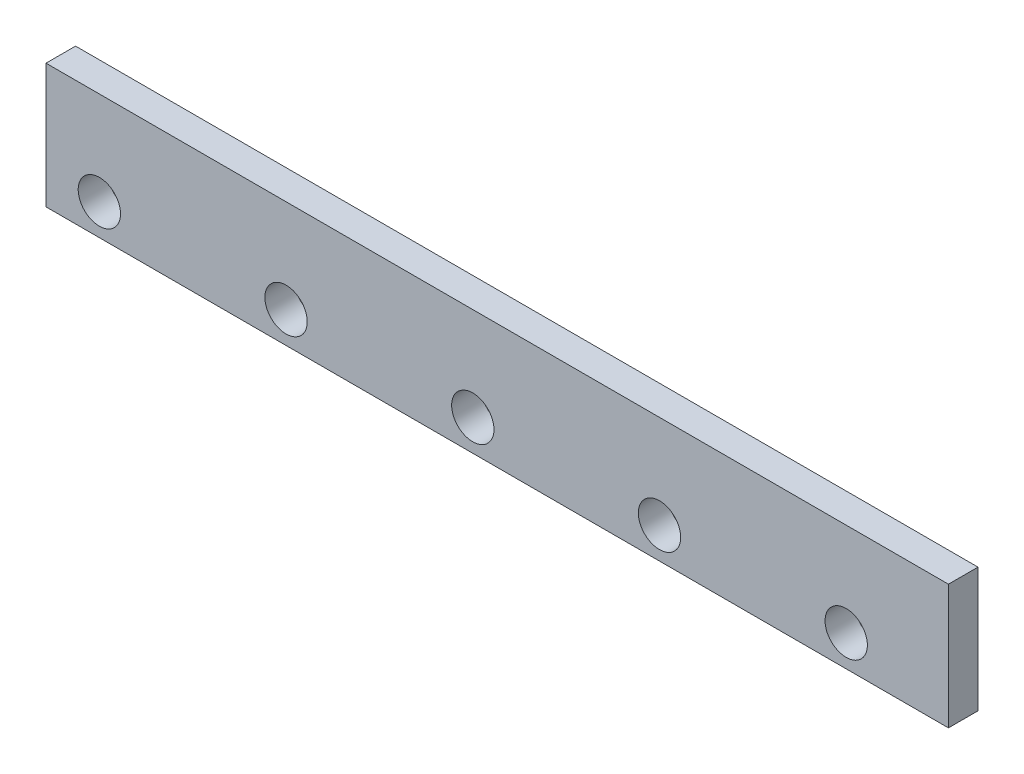
ISO-10303-21;
HEADER;
FILE_DESCRIPTION(('STEP AP214'),'2;1');
FILE_NAME('part.step','',(''),(''),'','','');
FILE_SCHEMA(('AUTOMOTIVE_DESIGN { 1 0 10303 214 1 1 1 1 }'));
ENDSEC;
DATA;
#1=APPLICATION_CONTEXT('core data for automotive mechanical design processes');
#2=APPLICATION_PROTOCOL_DEFINITION('international standard','automotive_design',2000,#1);
#3=PRODUCT_CONTEXT('',#1,'mechanical');
#4=PRODUCT('Part','Part','',(#3));
#5=PRODUCT_RELATED_PRODUCT_CATEGORY('part','',(#4));
#6=PRODUCT_DEFINITION_FORMATION('','',#4);
#7=PRODUCT_DEFINITION_CONTEXT('part definition',#1,'design');
#8=PRODUCT_DEFINITION('design','',#6,#7);
#9=PRODUCT_DEFINITION_SHAPE('','',#8);
#10=(LENGTH_UNIT() NAMED_UNIT(*) SI_UNIT(.MILLI.,.METRE.));
#11=(NAMED_UNIT(*) PLANE_ANGLE_UNIT() SI_UNIT($,.RADIAN.));
#12=(NAMED_UNIT(*) SI_UNIT($,.STERADIAN.) SOLID_ANGLE_UNIT());
#13=UNCERTAINTY_MEASURE_WITH_UNIT(LENGTH_MEASURE(1.E-05),#10,'distance_accuracy_value','');
#14=(GEOMETRIC_REPRESENTATION_CONTEXT(3) GLOBAL_UNCERTAINTY_ASSIGNED_CONTEXT((#13)) GLOBAL_UNIT_ASSIGNED_CONTEXT((#10,
#11,#12)) REPRESENTATION_CONTEXT('',''));
#15=CARTESIAN_POINT('',(0.,0.,0.));
#16=DIRECTION('',(0.,0.,1.));
#17=DIRECTION('',(1.,0.,0.));
#18=AXIS2_PLACEMENT_3D('',#15,#16,#17);
#19=CARTESIAN_POINT('',(0.,0.,19.));
#20=DIRECTION('',(0.,0.,-1.));
#21=DIRECTION('',(-1.,0.,0.));
#22=AXIS2_PLACEMENT_3D('',#19,#20,#21);
#23=PLANE('',#22);
#24=DIRECTION('',(0.,-1.,0.));
#25=VECTOR('',#24,1.);
#26=CARTESIAN_POINT('',(0.,0.,19.));
#27=LINE('',#26,#25);
#28=CARTESIAN_POINT('',(0.,80.,19.));
#29=VERTEX_POINT('',#28);
#30=CARTESIAN_POINT('',(0.,0.,19.));
#31=VERTEX_POINT('',#30);
#32=EDGE_CURVE('E85',#29,#31,#27,.T.);
#33=ORIENTED_EDGE('',*,*,#32,.T.);
#34=DIRECTION('',(1.,0.,0.));
#35=VECTOR('',#34,1.);
#36=CARTESIAN_POINT('',(0.,0.,19.));
#37=LINE('',#36,#35);
#38=CARTESIAN_POINT('',(580.,0.,19.));
#39=VERTEX_POINT('',#38);
#40=EDGE_CURVE('E80',#31,#39,#37,.T.);
#41=ORIENTED_EDGE('',*,*,#40,.T.);
#42=DIRECTION('',(0.,1.,0.));
#43=VECTOR('',#42,1.);
#44=CARTESIAN_POINT('',(580.,0.,19.));
#45=LINE('',#44,#43);
#46=CARTESIAN_POINT('',(580.,80.,19.));
#47=VERTEX_POINT('',#46);
#48=EDGE_CURVE('E83',#39,#47,#45,.T.);
#49=ORIENTED_EDGE('',*,*,#48,.T.);
#50=DIRECTION('',(-1.,0.,0.));
#51=VECTOR('',#50,1.);
#52=CARTESIAN_POINT('',(0.,80.,19.));
#53=LINE('',#52,#51);
#54=EDGE_CURVE('E50',#47,#29,#53,.T.);
#55=ORIENTED_EDGE('',*,*,#54,.T.);
#56=EDGE_LOOP('',(#33,#41,#49,#55));
#57=FACE_BOUND('',#56,.T.);
#58=CARTESIAN_POINT('',(34.2991665302462,20.0014828311874,19.));
#59=DIRECTION('',(0.,0.,1.));
#60=DIRECTION('',(1.,0.,0.));
#61=AXIS2_PLACEMENT_3D('',#58,#59,#60);
#62=CIRCLE('',#61,13.6068626288979);
#63=CARTESIAN_POINT('',(47.9060291591441,20.0014828311874,19.));
#64=VERTEX_POINT('',#63);
#65=EDGE_CURVE('E100',#64,#64,#62,.T.);
#66=ORIENTED_EDGE('',*,*,#65,.F.);
#67=EDGE_LOOP('',(#66));
#68=FACE_BOUND('',#67,.T.);
#69=CARTESIAN_POINT('',(154.299166530246,20.0014828311874,19.));
#70=DIRECTION('',(0.,0.,1.));
#71=DIRECTION('',(1.,0.,0.));
#72=AXIS2_PLACEMENT_3D('',#69,#70,#71);
#73=CIRCLE('',#72,13.6068626288979);
#74=CARTESIAN_POINT('',(167.906029159144,20.0014828311874,19.));
#75=VERTEX_POINT('',#74);
#76=EDGE_CURVE('E115',#75,#75,#73,.T.);
#77=ORIENTED_EDGE('',*,*,#76,.F.);
#78=EDGE_LOOP('',(#77));
#79=FACE_BOUND('',#78,.T.);
#80=CARTESIAN_POINT('',(274.299166530246,20.0014828311874,19.));
#81=DIRECTION('',(0.,0.,1.));
#82=DIRECTION('',(1.,0.,0.));
#83=AXIS2_PLACEMENT_3D('',#80,#81,#82);
#84=CIRCLE('',#83,13.6068626288979);
#85=CARTESIAN_POINT('',(287.906029159144,20.0014828311874,19.));
#86=VERTEX_POINT('',#85);
#87=EDGE_CURVE('E121',#86,#86,#84,.T.);
#88=ORIENTED_EDGE('',*,*,#87,.F.);
#89=EDGE_LOOP('',(#88));
#90=FACE_BOUND('',#89,.T.);
#91=CARTESIAN_POINT('',(394.299166530246,20.0014828311874,19.));
#92=DIRECTION('',(0.,0.,1.));
#93=DIRECTION('',(1.,0.,0.));
#94=AXIS2_PLACEMENT_3D('',#91,#92,#93);
#95=CIRCLE('',#94,13.6068626288979);
#96=CARTESIAN_POINT('',(407.906029159144,20.0014828311874,19.));
#97=VERTEX_POINT('',#96);
#98=EDGE_CURVE('E127',#97,#97,#95,.T.);
#99=ORIENTED_EDGE('',*,*,#98,.F.);
#100=EDGE_LOOP('',(#99));
#101=FACE_BOUND('',#100,.T.);
#102=CARTESIAN_POINT('',(514.299166530246,20.0014828311874,19.));
#103=DIRECTION('',(0.,0.,1.));
#104=DIRECTION('',(1.,0.,0.));
#105=AXIS2_PLACEMENT_3D('',#102,#103,#104);
#106=CIRCLE('',#105,13.6068626288979);
#107=CARTESIAN_POINT('',(527.906029159144,20.0014828311874,19.));
#108=VERTEX_POINT('',#107);
#109=EDGE_CURVE('E133',#108,#108,#106,.T.);
#110=ORIENTED_EDGE('',*,*,#109,.F.);
#111=EDGE_LOOP('',(#110));
#112=FACE_BOUND('',#111,.T.);
#113=ADVANCED_FACE('F33',(#57,#68,#79,#90,#101,#112),#23,.F.);
#114=CARTESIAN_POINT('',(0.,0.,0.));
#115=DIRECTION('',(0.,0.,-1.));
#116=DIRECTION('',(-1.,0.,0.));
#117=AXIS2_PLACEMENT_3D('',#114,#115,#116);
#118=PLANE('',#117);
#119=CARTESIAN_POINT('',(394.299166530246,20.0014828311874,0.));
#120=DIRECTION('',(0.,0.,1.));
#121=DIRECTION('',(1.,0.,0.));
#122=AXIS2_PLACEMENT_3D('',#119,#120,#121);
#123=CIRCLE('',#122,13.6068626288979);
#124=CARTESIAN_POINT('',(407.906029159144,20.0014828311874,0.));
#125=VERTEX_POINT('',#124);
#126=EDGE_CURVE('E130',#125,#125,#123,.T.);
#127=ORIENTED_EDGE('',*,*,#126,.T.);
#128=EDGE_LOOP('',(#127));
#129=FACE_BOUND('',#128,.T.);
#130=CARTESIAN_POINT('',(154.299166530246,20.0014828311874,0.));
#131=DIRECTION('',(0.,0.,1.));
#132=DIRECTION('',(1.,0.,0.));
#133=AXIS2_PLACEMENT_3D('',#130,#131,#132);
#134=CIRCLE('',#133,13.6068626288979);
#135=CARTESIAN_POINT('',(167.906029159144,20.0014828311874,0.));
#136=VERTEX_POINT('',#135);
#137=EDGE_CURVE('E118',#136,#136,#134,.T.);
#138=ORIENTED_EDGE('',*,*,#137,.T.);
#139=EDGE_LOOP('',(#138));
#140=FACE_BOUND('',#139,.T.);
#141=DIRECTION('',(0.,-1.,0.));
#142=VECTOR('',#141,1.);
#143=CARTESIAN_POINT('',(0.,0.,0.));
#144=LINE('',#143,#142);
#145=CARTESIAN_POINT('',(0.,80.,0.));
#146=VERTEX_POINT('',#145);
#147=CARTESIAN_POINT('',(0.,0.,0.));
#148=VERTEX_POINT('',#147);
#149=EDGE_CURVE('E97',#146,#148,#144,.T.);
#150=ORIENTED_EDGE('',*,*,#149,.F.);
#151=DIRECTION('',(-1.,0.,0.));
#152=VECTOR('',#151,1.);
#153=CARTESIAN_POINT('',(0.,80.,0.));
#154=LINE('',#153,#152);
#155=CARTESIAN_POINT('',(580.,80.,0.));
#156=VERTEX_POINT('',#155);
#157=EDGE_CURVE('E73',#156,#146,#154,.T.);
#158=ORIENTED_EDGE('',*,*,#157,.F.);
#159=DIRECTION('',(0.,1.,0.));
#160=VECTOR('',#159,1.);
#161=CARTESIAN_POINT('',(580.,0.,0.));
#162=LINE('',#161,#160);
#163=CARTESIAN_POINT('',(580.,0.,0.));
#164=VERTEX_POINT('',#163);
#165=EDGE_CURVE('E67',#164,#156,#162,.T.);
#166=ORIENTED_EDGE('',*,*,#165,.F.);
#167=DIRECTION('',(1.,0.,0.));
#168=VECTOR('',#167,1.);
#169=CARTESIAN_POINT('',(0.,0.,0.));
#170=LINE('',#169,#168);
#171=EDGE_CURVE('E89',#148,#164,#170,.T.);
#172=ORIENTED_EDGE('',*,*,#171,.F.);
#173=EDGE_LOOP('',(#150,#158,#166,#172));
#174=FACE_BOUND('',#173,.T.);
#175=CARTESIAN_POINT('',(34.2991665302462,20.0014828311874,0.));
#176=DIRECTION('',(0.,0.,1.));
#177=DIRECTION('',(1.,0.,0.));
#178=AXIS2_PLACEMENT_3D('',#175,#176,#177);
#179=CIRCLE('',#178,13.6068626288979);
#180=CARTESIAN_POINT('',(47.9060291591441,20.0014828311874,0.));
#181=VERTEX_POINT('',#180);
#182=EDGE_CURVE('E112',#181,#181,#179,.T.);
#183=ORIENTED_EDGE('',*,*,#182,.T.);
#184=EDGE_LOOP('',(#183));
#185=FACE_BOUND('',#184,.T.);
#186=CARTESIAN_POINT('',(274.299166530246,20.0014828311874,0.));
#187=DIRECTION('',(0.,0.,1.));
#188=DIRECTION('',(1.,0.,0.));
#189=AXIS2_PLACEMENT_3D('',#186,#187,#188);
#190=CIRCLE('',#189,13.6068626288979);
#191=CARTESIAN_POINT('',(287.906029159144,20.0014828311874,0.));
#192=VERTEX_POINT('',#191);
#193=EDGE_CURVE('E124',#192,#192,#190,.T.);
#194=ORIENTED_EDGE('',*,*,#193,.T.);
#195=EDGE_LOOP('',(#194));
#196=FACE_BOUND('',#195,.T.);
#197=CARTESIAN_POINT('',(514.299166530246,20.0014828311874,0.));
#198=DIRECTION('',(0.,0.,1.));
#199=DIRECTION('',(1.,0.,0.));
#200=AXIS2_PLACEMENT_3D('',#197,#198,#199);
#201=CIRCLE('',#200,13.6068626288979);
#202=CARTESIAN_POINT('',(527.906029159144,20.0014828311874,0.));
#203=VERTEX_POINT('',#202);
#204=EDGE_CURVE('E136',#203,#203,#201,.T.);
#205=ORIENTED_EDGE('',*,*,#204,.T.);
#206=EDGE_LOOP('',(#205));
#207=FACE_BOUND('',#206,.T.);
#208=ADVANCED_FACE('F108',(#129,#140,#174,#185,#196,#207),#118,.T.);
#209=CARTESIAN_POINT('',(0.,0.,19.));
#210=DIRECTION('',(1.,0.,0.));
#211=DIRECTION('',(0.,0.,-1.));
#212=AXIS2_PLACEMENT_3D('',#209,#210,#211);
#213=PLANE('',#212);
#214=ORIENTED_EDGE('',*,*,#149,.T.);
#215=DIRECTION('',(0.,0.,-1.));
#216=VECTOR('',#215,1.);
#217=CARTESIAN_POINT('',(0.,0.,19.));
#218=LINE('',#217,#216);
#219=EDGE_CURVE('E11',#31,#148,#218,.T.);
#220=ORIENTED_EDGE('',*,*,#219,.F.);
#221=ORIENTED_EDGE('',*,*,#32,.F.);
#222=DIRECTION('',(0.,0.,-1.));
#223=VECTOR('',#222,1.);
#224=CARTESIAN_POINT('',(0.,80.,19.));
#225=LINE('',#224,#223);
#226=EDGE_CURVE('E93',#29,#146,#225,.T.);
#227=ORIENTED_EDGE('',*,*,#226,.T.);
#228=EDGE_LOOP('',(#214,#220,#221,#227));
#229=FACE_BOUND('',#228,.T.);
#230=ADVANCED_FACE('F35',(#229),#213,.F.);
#231=CARTESIAN_POINT('',(0.,0.,19.));
#232=DIRECTION('',(0.,1.,0.));
#233=DIRECTION('',(0.,0.,1.));
#234=AXIS2_PLACEMENT_3D('',#231,#232,#233);
#235=PLANE('',#234);
#236=ORIENTED_EDGE('',*,*,#171,.T.);
#237=DIRECTION('',(0.,0.,-1.));
#238=VECTOR('',#237,1.);
#239=CARTESIAN_POINT('',(580.,0.,19.));
#240=LINE('',#239,#238);
#241=EDGE_CURVE('E42',#39,#164,#240,.T.);
#242=ORIENTED_EDGE('',*,*,#241,.F.);
#243=ORIENTED_EDGE('',*,*,#40,.F.);
#244=ORIENTED_EDGE('',*,*,#219,.T.);
#245=EDGE_LOOP('',(#236,#242,#243,#244));
#246=FACE_BOUND('',#245,.T.);
#247=ADVANCED_FACE('F88',(#246),#235,.F.);
#248=CARTESIAN_POINT('',(580.,0.,19.));
#249=DIRECTION('',(-1.,0.,0.));
#250=DIRECTION('',(0.,0.,1.));
#251=AXIS2_PLACEMENT_3D('',#248,#249,#250);
#252=PLANE('',#251);
#253=ORIENTED_EDGE('',*,*,#165,.T.);
#254=DIRECTION('',(0.,0.,-1.));
#255=VECTOR('',#254,1.);
#256=CARTESIAN_POINT('',(580.,80.,19.));
#257=LINE('',#256,#255);
#258=EDGE_CURVE('E90',#47,#156,#257,.T.);
#259=ORIENTED_EDGE('',*,*,#258,.F.);
#260=ORIENTED_EDGE('',*,*,#48,.F.);
#261=ORIENTED_EDGE('',*,*,#241,.T.);
#262=EDGE_LOOP('',(#253,#259,#260,#261));
#263=FACE_BOUND('',#262,.T.);
#264=ADVANCED_FACE('F91',(#263),#252,.F.);
#265=CARTESIAN_POINT('',(0.,80.,19.));
#266=DIRECTION('',(0.,-1.,0.));
#267=DIRECTION('',(0.,0.,-1.));
#268=AXIS2_PLACEMENT_3D('',#265,#266,#267);
#269=PLANE('',#268);
#270=ORIENTED_EDGE('',*,*,#157,.T.);
#271=ORIENTED_EDGE('',*,*,#226,.F.);
#272=ORIENTED_EDGE('',*,*,#54,.F.);
#273=ORIENTED_EDGE('',*,*,#258,.T.);
#274=EDGE_LOOP('',(#270,#271,#272,#273));
#275=FACE_BOUND('',#274,.T.);
#276=ADVANCED_FACE('F105',(#275),#269,.F.);
#277=CARTESIAN_POINT('',(34.2991665302462,20.0014828311874,19.));
#278=DIRECTION('',(0.,0.,-1.));
#279=DIRECTION('',(-1.,0.,0.));
#280=AXIS2_PLACEMENT_3D('',#277,#278,#279);
#281=CYLINDRICAL_SURFACE('',#280,13.6068626288979);
#282=ORIENTED_EDGE('',*,*,#65,.T.);
#283=EDGE_LOOP('',(#282));
#284=FACE_BOUND('',#283,.T.);
#285=ORIENTED_EDGE('',*,*,#182,.F.);
#286=EDGE_LOOP('',(#285));
#287=FACE_BOUND('',#286,.T.);
#288=ADVANCED_FACE('F153',(#284,#287),#281,.F.);
#289=CARTESIAN_POINT('',(154.299166530246,20.0014828311874,19.));
#290=DIRECTION('',(0.,0.,-1.));
#291=DIRECTION('',(-1.,0.,0.));
#292=AXIS2_PLACEMENT_3D('',#289,#290,#291);
#293=CYLINDRICAL_SURFACE('',#292,13.6068626288979);
#294=ORIENTED_EDGE('',*,*,#76,.T.);
#295=EDGE_LOOP('',(#294));
#296=FACE_BOUND('',#295,.T.);
#297=ORIENTED_EDGE('',*,*,#137,.F.);
#298=EDGE_LOOP('',(#297));
#299=FACE_BOUND('',#298,.T.);
#300=ADVANCED_FACE('F199',(#296,#299),#293,.F.);
#301=CARTESIAN_POINT('',(274.299166530246,20.0014828311874,19.));
#302=DIRECTION('',(0.,0.,-1.));
#303=DIRECTION('',(-1.,0.,0.));
#304=AXIS2_PLACEMENT_3D('',#301,#302,#303);
#305=CYLINDRICAL_SURFACE('',#304,13.6068626288979);
#306=ORIENTED_EDGE('',*,*,#87,.T.);
#307=EDGE_LOOP('',(#306));
#308=FACE_BOUND('',#307,.T.);
#309=ORIENTED_EDGE('',*,*,#193,.F.);
#310=EDGE_LOOP('',(#309));
#311=FACE_BOUND('',#310,.T.);
#312=ADVANCED_FACE('F207',(#308,#311),#305,.F.);
#313=CARTESIAN_POINT('',(394.299166530246,20.0014828311874,19.));
#314=DIRECTION('',(0.,0.,-1.));
#315=DIRECTION('',(-1.,0.,0.));
#316=AXIS2_PLACEMENT_3D('',#313,#314,#315);
#317=CYLINDRICAL_SURFACE('',#316,13.6068626288979);
#318=ORIENTED_EDGE('',*,*,#98,.T.);
#319=EDGE_LOOP('',(#318));
#320=FACE_BOUND('',#319,.T.);
#321=ORIENTED_EDGE('',*,*,#126,.F.);
#322=EDGE_LOOP('',(#321));
#323=FACE_BOUND('',#322,.T.);
#324=ADVANCED_FACE('F215',(#320,#323),#317,.F.);
#325=CARTESIAN_POINT('',(514.299166530246,20.0014828311874,19.));
#326=DIRECTION('',(0.,0.,-1.));
#327=DIRECTION('',(-1.,0.,0.));
#328=AXIS2_PLACEMENT_3D('',#325,#326,#327);
#329=CYLINDRICAL_SURFACE('',#328,13.6068626288979);
#330=ORIENTED_EDGE('',*,*,#109,.T.);
#331=EDGE_LOOP('',(#330));
#332=FACE_BOUND('',#331,.T.);
#333=ORIENTED_EDGE('',*,*,#204,.F.);
#334=EDGE_LOOP('',(#333));
#335=FACE_BOUND('',#334,.T.);
#336=ADVANCED_FACE('F142',(#332,#335),#329,.F.);
#337=CLOSED_SHELL('',(#113,#208,#230,#247,#264,#276,#288,#300,#312,#324,#336));
#338=MANIFOLD_SOLID_BREP('B2',#337);
#339=ADVANCED_BREP_SHAPE_REPRESENTATION('',(#18,#338),#14);
#340=SHAPE_DEFINITION_REPRESENTATION(#9,#339);
ENDSEC;
END-ISO-10303-21;
